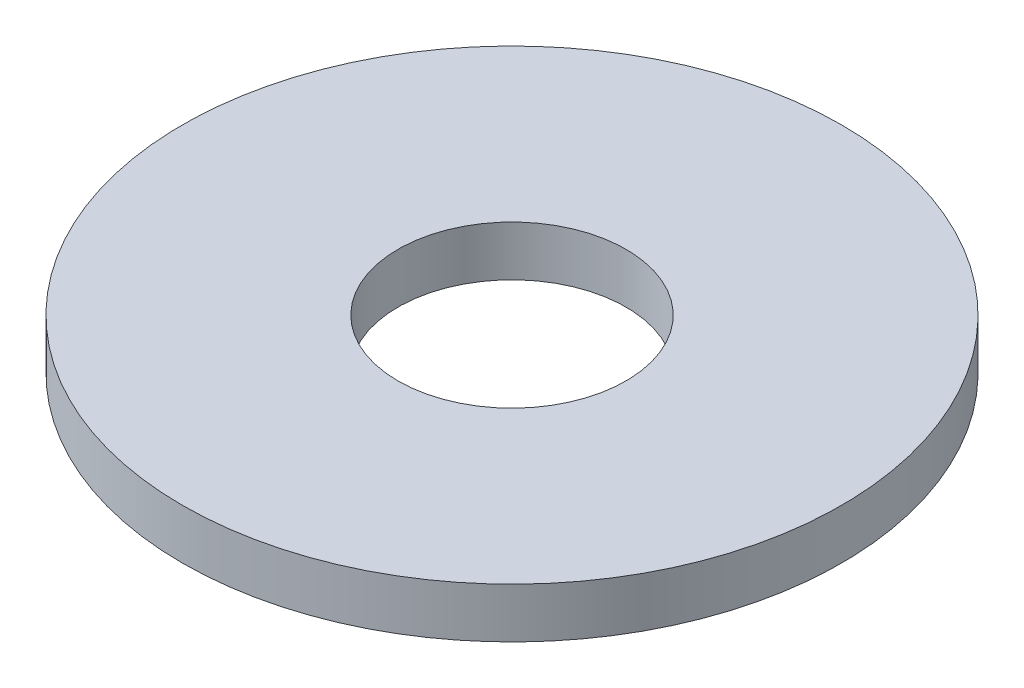
ISO-10303-21;
HEADER;
FILE_DESCRIPTION(('STEP AP214'),'2;1');
FILE_NAME('part.step','',(''),(''),'','','');
FILE_SCHEMA(('AUTOMOTIVE_DESIGN { 1 0 10303 214 1 1 1 1 }'));
ENDSEC;
DATA;
#1=APPLICATION_CONTEXT('core data for automotive mechanical design processes');
#2=APPLICATION_PROTOCOL_DEFINITION('international standard','automotive_design',2000,#1);
#3=PRODUCT_CONTEXT('',#1,'mechanical');
#4=PRODUCT('Part','Part','',(#3));
#5=PRODUCT_RELATED_PRODUCT_CATEGORY('part','',(#4));
#6=PRODUCT_DEFINITION_FORMATION('','',#4);
#7=PRODUCT_DEFINITION_CONTEXT('part definition',#1,'design');
#8=PRODUCT_DEFINITION('design','',#6,#7);
#9=PRODUCT_DEFINITION_SHAPE('','',#8);
#10=(LENGTH_UNIT() NAMED_UNIT(*) SI_UNIT(.MILLI.,.METRE.));
#11=(NAMED_UNIT(*) PLANE_ANGLE_UNIT() SI_UNIT($,.RADIAN.));
#12=(NAMED_UNIT(*) SI_UNIT($,.STERADIAN.) SOLID_ANGLE_UNIT());
#13=UNCERTAINTY_MEASURE_WITH_UNIT(LENGTH_MEASURE(1.E-05),#10,'distance_accuracy_value','');
#14=(GEOMETRIC_REPRESENTATION_CONTEXT(3) GLOBAL_UNCERTAINTY_ASSIGNED_CONTEXT((#13)) GLOBAL_UNIT_ASSIGNED_CONTEXT((#10,
#11,#12)) REPRESENTATION_CONTEXT('',''));
#15=CARTESIAN_POINT('',(0.,0.,0.));
#16=DIRECTION('',(0.,0.,1.));
#17=DIRECTION('',(1.,0.,0.));
#18=AXIS2_PLACEMENT_3D('',#15,#16,#17);
#19=CARTESIAN_POINT('',(0.,1.8,0.));
#20=DIRECTION('',(0.,1.,0.));
#21=DIRECTION('',(0.,0.,1.));
#22=AXIS2_PLACEMENT_3D('',#19,#20,#21);
#23=PLANE('',#22);
#24=CARTESIAN_POINT('',(0.,1.8,0.));
#25=DIRECTION('',(0.,1.,0.));
#26=DIRECTION('',(0.,0.,1.));
#27=AXIS2_PLACEMENT_3D('',#24,#25,#26);
#28=CIRCLE('',#27,11.85);
#29=CARTESIAN_POINT('',(0.,1.8,11.85));
#30=VERTEX_POINT('',#29);
#31=EDGE_CURVE('E10',#30,#30,#28,.T.);
#32=ORIENTED_EDGE('',*,*,#31,.T.);
#33=EDGE_LOOP('',(#32));
#34=FACE_BOUND('',#33,.T.);
#35=CARTESIAN_POINT('',(0.,1.8,0.));
#36=DIRECTION('',(0.,1.,0.));
#37=DIRECTION('',(0.,0.,1.));
#38=AXIS2_PLACEMENT_3D('',#35,#36,#37);
#39=CIRCLE('',#38,4.1);
#40=CARTESIAN_POINT('',(0.,1.8,4.1));
#41=VERTEX_POINT('',#40);
#42=EDGE_CURVE('E43',#41,#41,#39,.T.);
#43=ORIENTED_EDGE('',*,*,#42,.F.);
#44=EDGE_LOOP('',(#43));
#45=FACE_BOUND('',#44,.T.);
#46=ADVANCED_FACE('F32',(#34,#45),#23,.T.);
#47=CARTESIAN_POINT('',(0.,0.,0.));
#48=DIRECTION('',(0.,1.,0.));
#49=DIRECTION('',(0.,0.,1.));
#50=AXIS2_PLACEMENT_3D('',#47,#48,#49);
#51=PLANE('',#50);
#52=CARTESIAN_POINT('',(0.,0.,0.));
#53=DIRECTION('',(0.,1.,0.));
#54=DIRECTION('',(0.,0.,1.));
#55=AXIS2_PLACEMENT_3D('',#52,#53,#54);
#56=CIRCLE('',#55,11.85);
#57=CARTESIAN_POINT('',(0.,0.,11.85));
#58=VERTEX_POINT('',#57);
#59=EDGE_CURVE('E36',#58,#58,#56,.T.);
#60=ORIENTED_EDGE('',*,*,#59,.F.);
#61=EDGE_LOOP('',(#60));
#62=FACE_BOUND('',#61,.T.);
#63=CARTESIAN_POINT('',(0.,0.,0.));
#64=DIRECTION('',(0.,1.,0.));
#65=DIRECTION('',(0.,0.,1.));
#66=AXIS2_PLACEMENT_3D('',#63,#64,#65);
#67=CIRCLE('',#66,4.1);
#68=CARTESIAN_POINT('',(0.,0.,4.1));
#69=VERTEX_POINT('',#68);
#70=EDGE_CURVE('E45',#69,#69,#67,.T.);
#71=ORIENTED_EDGE('',*,*,#70,.T.);
#72=EDGE_LOOP('',(#71));
#73=FACE_BOUND('',#72,.T.);
#74=ADVANCED_FACE('F55',(#62,#73),#51,.F.);
#75=CARTESIAN_POINT('',(0.,1.8,0.));
#76=DIRECTION('',(0.,-1.,0.));
#77=DIRECTION('',(0.,0.,-1.));
#78=AXIS2_PLACEMENT_3D('',#75,#76,#77);
#79=CYLINDRICAL_SURFACE('',#78,11.85);
#80=ORIENTED_EDGE('',*,*,#31,.F.);
#81=EDGE_LOOP('',(#80));
#82=FACE_BOUND('',#81,.T.);
#83=ORIENTED_EDGE('',*,*,#59,.T.);
#84=EDGE_LOOP('',(#83));
#85=FACE_BOUND('',#84,.T.);
#86=ADVANCED_FACE('F34',(#82,#85),#79,.T.);
#87=CARTESIAN_POINT('',(0.,1.8,0.));
#88=DIRECTION('',(0.,-1.,0.));
#89=DIRECTION('',(0.,0.,-1.));
#90=AXIS2_PLACEMENT_3D('',#87,#88,#89);
#91=CYLINDRICAL_SURFACE('',#90,4.1);
#92=ORIENTED_EDGE('',*,*,#42,.T.);
#93=EDGE_LOOP('',(#92));
#94=FACE_BOUND('',#93,.T.);
#95=ORIENTED_EDGE('',*,*,#70,.F.);
#96=EDGE_LOOP('',(#95));
#97=FACE_BOUND('',#96,.T.);
#98=ADVANCED_FACE('F51',(#94,#97),#91,.F.);
#99=CLOSED_SHELL('',(#46,#74,#86,#98));
#100=MANIFOLD_SOLID_BREP('B2',#99);
#101=ADVANCED_BREP_SHAPE_REPRESENTATION('',(#18,#100),#14);
#102=SHAPE_DEFINITION_REPRESENTATION(#9,#101);
ENDSEC;
END-ISO-10303-21;
